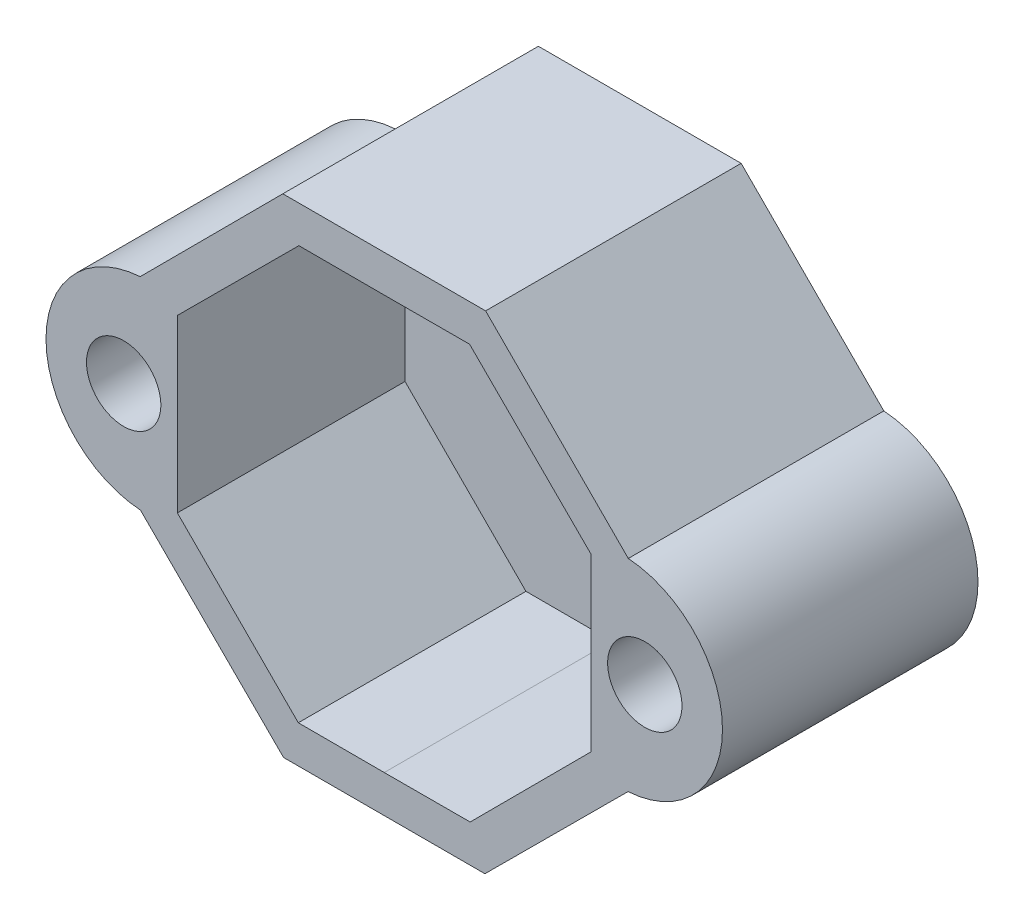
ISO-10303-21;
HEADER;
FILE_DESCRIPTION(('STEP AP214'),'2;1');
FILE_NAME('part.step','',(''),(''),'','','');
FILE_SCHEMA(('AUTOMOTIVE_DESIGN { 1 0 10303 214 1 1 1 1 }'));
ENDSEC;
DATA;
#1=APPLICATION_CONTEXT('core data for automotive mechanical design processes');
#2=APPLICATION_PROTOCOL_DEFINITION('international standard','automotive_design',2000,#1);
#3=PRODUCT_CONTEXT('',#1,'mechanical');
#4=PRODUCT('Part','Part','',(#3));
#5=PRODUCT_RELATED_PRODUCT_CATEGORY('part','',(#4));
#6=PRODUCT_DEFINITION_FORMATION('','',#4);
#7=PRODUCT_DEFINITION_CONTEXT('part definition',#1,'design');
#8=PRODUCT_DEFINITION('design','',#6,#7);
#9=PRODUCT_DEFINITION_SHAPE('','',#8);
#10=(LENGTH_UNIT() NAMED_UNIT(*) SI_UNIT(.MILLI.,.METRE.));
#11=(NAMED_UNIT(*) PLANE_ANGLE_UNIT() SI_UNIT($,.RADIAN.));
#12=(NAMED_UNIT(*) SI_UNIT($,.STERADIAN.) SOLID_ANGLE_UNIT());
#13=UNCERTAINTY_MEASURE_WITH_UNIT(LENGTH_MEASURE(1.E-05),#10,'distance_accuracy_value','');
#14=(GEOMETRIC_REPRESENTATION_CONTEXT(3) GLOBAL_UNCERTAINTY_ASSIGNED_CONTEXT((#13)) GLOBAL_UNIT_ASSIGNED_CONTEXT((#10,
#11,#12)) REPRESENTATION_CONTEXT('',''));
#15=CARTESIAN_POINT('',(0.,0.,0.));
#16=DIRECTION('',(0.,0.,1.));
#17=DIRECTION('',(1.,0.,0.));
#18=AXIS2_PLACEMENT_3D('',#15,#16,#17);
#19=CARTESIAN_POINT('',(-4.36451658606529,10.4936603456736,1.2));
#20=DIRECTION('',(-0.708135002050255,0.706077062983415,0.));
#21=DIRECTION('',(-0.706077062983415,-0.708135002050255,0.));
#22=AXIS2_PLACEMENT_3D('',#19,#20,#21);
#23=PLANE('',#22);
#24=DIRECTION('',(-0.706077062983415,-0.708135002050255,0.));
#25=VECTOR('',#24,1.);
#26=CARTESIAN_POINT('',(-4.36451658606529,10.4936603456736,11.));
#27=LINE('',#26,#25);
#28=CARTESIAN_POINT('',(-4.36451658606529,10.4936603456736,11.));
#29=VERTEX_POINT('',#28);
#30=CARTESIAN_POINT('',(-10.5063170194626,4.33395896106958,11.));
#31=VERTEX_POINT('',#30);
#32=EDGE_CURVE('E276',#29,#31,#27,.T.);
#33=ORIENTED_EDGE('',*,*,#32,.F.);
#34=DIRECTION('',(0.,0.,1.));
#35=VECTOR('',#34,1.);
#36=CARTESIAN_POINT('',(-4.36451658606529,10.4936603456736,1.2));
#37=LINE('',#36,#35);
#38=CARTESIAN_POINT('',(-4.36451658606529,10.4936603456736,0.));
#39=VERTEX_POINT('',#38);
#40=EDGE_CURVE('E11',#39,#29,#37,.T.);
#41=ORIENTED_EDGE('',*,*,#40,.F.);
#42=DIRECTION('',(0.706077062983415,0.708135002050255,0.));
#43=VECTOR('',#42,1.);
#44=CARTESIAN_POINT('',(-10.5063170194626,4.33395896106958,0.));
#45=LINE('',#44,#43);
#46=CARTESIAN_POINT('',(-10.5063170194626,4.33395896106958,0.));
#47=VERTEX_POINT('',#46);
#48=EDGE_CURVE('E199',#47,#39,#45,.T.);
#49=ORIENTED_EDGE('',*,*,#48,.F.);
#50=DIRECTION('',(0.,0.,1.));
#51=VECTOR('',#50,1.);
#52=CARTESIAN_POINT('',(-10.5063170194626,4.33395896106958,1.2));
#53=LINE('',#52,#51);
#54=EDGE_CURVE('E36',#47,#31,#53,.T.);
#55=ORIENTED_EDGE('',*,*,#54,.T.);
#56=EDGE_LOOP('',(#33,#41,#49,#55));
#57=FACE_BOUND('',#56,.T.);
#58=ADVANCED_FACE('F33',(#57),#23,.T.);
#59=CARTESIAN_POINT('',(-4.36451658606529,10.4936603456736,1.2));
#60=DIRECTION('',(0.,1.,0.));
#61=DIRECTION('',(0.,0.,1.));
#62=AXIS2_PLACEMENT_3D('',#59,#60,#61);
#63=PLANE('',#62);
#64=DIRECTION('',(-1.,0.,0.));
#65=VECTOR('',#64,1.);
#66=CARTESIAN_POINT('',(-4.36451658606529,10.4936603456736,11.));
#67=LINE('',#66,#65);
#68=CARTESIAN_POINT('',(4.36451658606529,10.4936603456736,11.));
#69=VERTEX_POINT('',#68);
#70=EDGE_CURVE('E311',#69,#29,#67,.T.);
#71=ORIENTED_EDGE('',*,*,#70,.F.);
#72=DIRECTION('',(0.,0.,1.));
#73=VECTOR('',#72,1.);
#74=CARTESIAN_POINT('',(4.36451658606529,10.4936603456736,1.2));
#75=LINE('',#74,#73);
#76=CARTESIAN_POINT('',(4.36451658606529,10.4936603456736,0.));
#77=VERTEX_POINT('',#76);
#78=EDGE_CURVE('E41',#77,#69,#75,.T.);
#79=ORIENTED_EDGE('',*,*,#78,.F.);
#80=DIRECTION('',(1.,0.,0.));
#81=VECTOR('',#80,1.);
#82=CARTESIAN_POINT('',(-4.36451658606529,10.4936603456736,0.));
#83=LINE('',#82,#81);
#84=EDGE_CURVE('E202',#39,#77,#83,.T.);
#85=ORIENTED_EDGE('',*,*,#84,.F.);
#86=ORIENTED_EDGE('',*,*,#40,.T.);
#87=EDGE_LOOP('',(#71,#79,#85,#86));
#88=FACE_BOUND('',#87,.T.);
#89=ADVANCED_FACE('F332',(#88),#63,.T.);
#90=CARTESIAN_POINT('',(4.36451658606529,10.4936603456736,1.2));
#91=DIRECTION('',(0.708135002050255,0.706077062983415,0.));
#92=DIRECTION('',(-0.706077062983415,0.708135002050255,0.));
#93=AXIS2_PLACEMENT_3D('',#90,#91,#92);
#94=PLANE('',#93);
#95=DIRECTION('',(-0.706077062983415,0.708135002050255,0.));
#96=VECTOR('',#95,1.);
#97=CARTESIAN_POINT('',(4.36451658606529,10.4936603456736,11.));
#98=LINE('',#97,#96);
#99=CARTESIAN_POINT('',(10.5063170194626,4.33395896106958,11.));
#100=VERTEX_POINT('',#99);
#101=EDGE_CURVE('E308',#100,#69,#98,.T.);
#102=ORIENTED_EDGE('',*,*,#101,.F.);
#103=DIRECTION('',(0.,0.,1.));
#104=VECTOR('',#103,1.);
#105=CARTESIAN_POINT('',(10.5063170194626,4.33395896106958,1.2));
#106=LINE('',#105,#104);
#107=CARTESIAN_POINT('',(10.5063170194626,4.33395896106958,0.));
#108=VERTEX_POINT('',#107);
#109=EDGE_CURVE('E168',#108,#100,#106,.T.);
#110=ORIENTED_EDGE('',*,*,#109,.F.);
#111=DIRECTION('',(0.706077062983415,-0.708135002050255,0.));
#112=VECTOR('',#111,1.);
#113=CARTESIAN_POINT('',(4.36451658606529,10.4936603456736,0.));
#114=LINE('',#113,#112);
#115=EDGE_CURVE('E184',#77,#108,#114,.T.);
#116=ORIENTED_EDGE('',*,*,#115,.F.);
#117=ORIENTED_EDGE('',*,*,#78,.T.);
#118=EDGE_LOOP('',(#102,#110,#116,#117));
#119=FACE_BOUND('',#118,.T.);
#120=ADVANCED_FACE('F352',(#119),#94,.T.);
#121=CARTESIAN_POINT('',(10.2008513279981,-0.0148435541707614,1.2));
#122=DIRECTION('',(0.,0.,1.));
#123=DIRECTION('',(1.,0.,0.));
#124=AXIS2_PLACEMENT_3D('',#121,#122,#123);
#125=CYLINDRICAL_SURFACE('',#124,4.35951747389807);
#126=CARTESIAN_POINT('',(10.2008513279981,-0.0148435541707614,11.));
#127=DIRECTION('',(0.,0.,1.));
#128=DIRECTION('',(-1.,0.,0.));
#129=AXIS2_PLACEMENT_3D('',#126,#127,#128);
#130=CIRCLE('',#129,4.35951747389807);
#131=CARTESIAN_POINT('',(10.4936603456736,-4.36451658606529,11.));
#132=VERTEX_POINT('',#131);
#133=EDGE_CURVE('E164',#132,#100,#130,.T.);
#134=ORIENTED_EDGE('',*,*,#133,.F.);
#135=DIRECTION('',(0.,0.,1.));
#136=VECTOR('',#135,1.);
#137=CARTESIAN_POINT('',(10.4936603456736,-4.36451658606529,1.2));
#138=LINE('',#137,#136);
#139=CARTESIAN_POINT('',(10.4936603456736,-4.36451658606529,0.));
#140=VERTEX_POINT('',#139);
#141=EDGE_CURVE('E158',#140,#132,#138,.T.);
#142=ORIENTED_EDGE('',*,*,#141,.F.);
#143=CARTESIAN_POINT('',(10.2008513279981,-0.0148435541707614,0.));
#144=DIRECTION('',(0.,0.,-1.));
#145=DIRECTION('',(-1.,0.,0.));
#146=AXIS2_PLACEMENT_3D('',#143,#144,#145);
#147=CIRCLE('',#146,4.35951747389807);
#148=EDGE_CURVE('E162',#108,#140,#147,.T.);
#149=ORIENTED_EDGE('',*,*,#148,.F.);
#150=ORIENTED_EDGE('',*,*,#109,.T.);
#151=EDGE_LOOP('',(#134,#142,#149,#150));
#152=FACE_BOUND('',#151,.T.);
#153=ADVANCED_FACE('F160',(#152),#125,.T.);
#154=CARTESIAN_POINT('',(4.33395896106958,-10.5063170194626,1.2));
#155=DIRECTION('',(0.706077062983415,-0.708135002050255,0.));
#156=DIRECTION('',(0.708135002050255,0.706077062983415,0.));
#157=AXIS2_PLACEMENT_3D('',#154,#155,#156);
#158=PLANE('',#157);
#159=DIRECTION('',(0.708135002050255,0.706077062983415,0.));
#160=VECTOR('',#159,1.);
#161=CARTESIAN_POINT('',(4.33395896106958,-10.5063170194626,11.));
#162=LINE('',#161,#160);
#163=CARTESIAN_POINT('',(4.33395896106958,-10.5063170194626,11.));
#164=VERTEX_POINT('',#163);
#165=EDGE_CURVE('E305',#164,#132,#162,.T.);
#166=ORIENTED_EDGE('',*,*,#165,.F.);
#167=DIRECTION('',(0.,0.,1.));
#168=VECTOR('',#167,1.);
#169=CARTESIAN_POINT('',(4.33395896106958,-10.5063170194626,1.2));
#170=LINE('',#169,#168);
#171=CARTESIAN_POINT('',(4.33395896106958,-10.5063170194626,0.));
#172=VERTEX_POINT('',#171);
#173=EDGE_CURVE('E169',#172,#164,#170,.T.);
#174=ORIENTED_EDGE('',*,*,#173,.F.);
#175=DIRECTION('',(-0.708135002050255,-0.706077062983415,0.));
#176=VECTOR('',#175,1.);
#177=CARTESIAN_POINT('',(10.4936603456736,-4.36451658606529,0.));
#178=LINE('',#177,#176);
#179=EDGE_CURVE('E172',#140,#172,#178,.T.);
#180=ORIENTED_EDGE('',*,*,#179,.F.);
#181=ORIENTED_EDGE('',*,*,#141,.T.);
#182=EDGE_LOOP('',(#166,#174,#180,#181));
#183=FACE_BOUND('',#182,.T.);
#184=ADVANCED_FACE('F173',(#183),#158,.T.);
#185=CARTESIAN_POINT('',(-4.33395896106958,-10.5063170194626,1.2));
#186=DIRECTION('',(0.,-1.,0.));
#187=DIRECTION('',(0.,0.,-1.));
#188=AXIS2_PLACEMENT_3D('',#185,#186,#187);
#189=PLANE('',#188);
#190=DIRECTION('',(1.,0.,0.));
#191=VECTOR('',#190,1.);
#192=CARTESIAN_POINT('',(-4.33395896106958,-10.5063170194626,11.));
#193=LINE('',#192,#191);
#194=CARTESIAN_POINT('',(-4.33395896106958,-10.5063170194626,11.));
#195=VERTEX_POINT('',#194);
#196=EDGE_CURVE('E302',#195,#164,#193,.T.);
#197=ORIENTED_EDGE('',*,*,#196,.F.);
#198=DIRECTION('',(0.,0.,1.));
#199=VECTOR('',#198,1.);
#200=CARTESIAN_POINT('',(-4.33395896106958,-10.5063170194626,1.2));
#201=LINE('',#200,#199);
#202=CARTESIAN_POINT('',(-4.33395896106958,-10.5063170194626,0.));
#203=VERTEX_POINT('',#202);
#204=EDGE_CURVE('E317',#203,#195,#201,.T.);
#205=ORIENTED_EDGE('',*,*,#204,.F.);
#206=DIRECTION('',(-1.,0.,0.));
#207=VECTOR('',#206,1.);
#208=CARTESIAN_POINT('',(4.33395896106958,-10.5063170194626,0.));
#209=LINE('',#208,#207);
#210=EDGE_CURVE('E177',#172,#203,#209,.T.);
#211=ORIENTED_EDGE('',*,*,#210,.F.);
#212=ORIENTED_EDGE('',*,*,#173,.T.);
#213=EDGE_LOOP('',(#197,#205,#211,#212));
#214=FACE_BOUND('',#213,.T.);
#215=ADVANCED_FACE('F339',(#214),#189,.T.);
#216=CARTESIAN_POINT('',(-4.33395896106958,-10.5063170194626,1.2));
#217=DIRECTION('',(-0.706077062983415,-0.708135002050255,0.));
#218=DIRECTION('',(0.708135002050255,-0.706077062983415,0.));
#219=AXIS2_PLACEMENT_3D('',#216,#217,#218);
#220=PLANE('',#219);
#221=DIRECTION('',(0.708135002050255,-0.706077062983415,0.));
#222=VECTOR('',#221,1.);
#223=CARTESIAN_POINT('',(-4.33395896106958,-10.5063170194626,11.));
#224=LINE('',#223,#222);
#225=CARTESIAN_POINT('',(-10.4936603456736,-4.36451658606529,11.));
#226=VERTEX_POINT('',#225);
#227=EDGE_CURVE('E299',#226,#195,#224,.T.);
#228=ORIENTED_EDGE('',*,*,#227,.F.);
#229=DIRECTION('',(0.,0.,1.));
#230=VECTOR('',#229,1.);
#231=CARTESIAN_POINT('',(-10.4936603456736,-4.36451658606529,1.2));
#232=LINE('',#231,#230);
#233=CARTESIAN_POINT('',(-10.4936603456736,-4.36451658606529,0.));
#234=VERTEX_POINT('',#233);
#235=EDGE_CURVE('E318',#234,#226,#232,.T.);
#236=ORIENTED_EDGE('',*,*,#235,.F.);
#237=DIRECTION('',(-0.708135002050255,0.706077062983415,0.));
#238=VECTOR('',#237,1.);
#239=CARTESIAN_POINT('',(-4.33395896106958,-10.5063170194626,0.));
#240=LINE('',#239,#238);
#241=EDGE_CURVE('E193',#203,#234,#240,.T.);
#242=ORIENTED_EDGE('',*,*,#241,.F.);
#243=ORIENTED_EDGE('',*,*,#204,.T.);
#244=EDGE_LOOP('',(#228,#236,#242,#243));
#245=FACE_BOUND('',#244,.T.);
#246=ADVANCED_FACE('F336',(#245),#220,.T.);
#247=CARTESIAN_POINT('',(-10.2008513279981,-0.0148435541707614,1.2));
#248=DIRECTION('',(0.,0.,1.));
#249=DIRECTION('',(1.,0.,0.));
#250=AXIS2_PLACEMENT_3D('',#247,#248,#249);
#251=CYLINDRICAL_SURFACE('',#250,4.35951747389807);
#252=CARTESIAN_POINT('',(-10.2008513279981,-0.0148435541707614,11.));
#253=DIRECTION('',(0.,0.,1.));
#254=DIRECTION('',(1.,0.,0.));
#255=AXIS2_PLACEMENT_3D('',#252,#253,#254);
#256=CIRCLE('',#255,4.35951747389807);
#257=EDGE_CURVE('E296',#31,#226,#256,.T.);
#258=ORIENTED_EDGE('',*,*,#257,.F.);
#259=ORIENTED_EDGE('',*,*,#54,.F.);
#260=CARTESIAN_POINT('',(-10.2008513279981,-0.0148435541707614,0.));
#261=DIRECTION('',(0.,0.,-1.));
#262=DIRECTION('',(-1.,0.,0.));
#263=AXIS2_PLACEMENT_3D('',#260,#261,#262);
#264=CIRCLE('',#263,4.35951747389807);
#265=EDGE_CURVE('E196',#234,#47,#264,.T.);
#266=ORIENTED_EDGE('',*,*,#265,.F.);
#267=ORIENTED_EDGE('',*,*,#235,.T.);
#268=EDGE_LOOP('',(#258,#259,#266,#267));
#269=FACE_BOUND('',#268,.T.);
#270=ADVANCED_FACE('F326',(#269),#251,.T.);
#271=CARTESIAN_POINT('',(-10.2008513279981,-0.0148435541707614,11.));
#272=DIRECTION('',(0.,0.,1.));
#273=DIRECTION('',(1.,0.,0.));
#274=AXIS2_PLACEMENT_3D('',#271,#272,#273);
#275=PLANE('',#274);
#276=CARTESIAN_POINT('',(11.2171797081828,-0.00887619444256418,11.));
#277=DIRECTION('',(0.,0.,1.));
#278=DIRECTION('',(1.,0.,0.));
#279=AXIS2_PLACEMENT_3D('',#276,#277,#278);
#280=CIRCLE('',#279,1.60000012368346);
#281=CARTESIAN_POINT('',(12.8171798318663,-0.00887619444256418,11.));
#282=VERTEX_POINT('',#281);
#283=EDGE_CURVE('E205',#282,#282,#280,.T.);
#284=ORIENTED_EDGE('',*,*,#283,.F.);
#285=EDGE_LOOP('',(#284));
#286=FACE_BOUND('',#285,.T.);
#287=CARTESIAN_POINT('',(-11.2171797081828,-0.00887619444256418,11.));
#288=DIRECTION('',(0.,0.,1.));
#289=DIRECTION('',(-1.,0.,0.));
#290=AXIS2_PLACEMENT_3D('',#287,#288,#289);
#291=CIRCLE('',#290,1.60000012368346);
#292=CARTESIAN_POINT('',(-12.8171798318663,-0.00887619444256418,11.));
#293=VERTEX_POINT('',#292);
#294=EDGE_CURVE('E209',#293,#293,#291,.T.);
#295=ORIENTED_EDGE('',*,*,#294,.F.);
#296=EDGE_LOOP('',(#295));
#297=FACE_BOUND('',#296,.T.);
#298=DIRECTION('',(-0.708135012325157,-0.706077052678565,0.));
#299=VECTOR('',#298,1.);
#300=CARTESIAN_POINT('',(-3.67354624904692,8.90535488724709,11.));
#301=LINE('',#300,#299);
#302=CARTESIAN_POINT('',(-3.67354624904692,8.90535488724709,11.));
#303=VERTEX_POINT('',#302);
#304=CARTESIAN_POINT('',(-8.89462698251009,3.6994474940002,11.));
#305=VERTEX_POINT('',#304);
#306=EDGE_CURVE('E57',#303,#305,#301,.T.);
#307=ORIENTED_EDGE('',*,*,#306,.F.);
#308=DIRECTION('',(-0.999998941449941,0.00145502542859038,0.));
#309=VECTOR('',#308,1.);
#310=CARTESIAN_POINT('',(0.,8.90000977838355,11.));
#311=LINE('',#310,#309);
#312=CARTESIAN_POINT('',(0.,8.90000977838355,11.));
#313=VERTEX_POINT('',#312);
#314=EDGE_CURVE('E221',#313,#303,#311,.T.);
#315=ORIENTED_EDGE('',*,*,#314,.F.);
#316=DIRECTION('',(-0.999998941449941,-0.00145502542859038,0.));
#317=VECTOR('',#316,1.);
#318=CARTESIAN_POINT('',(0.,8.90000977838355,11.));
#319=LINE('',#318,#317);
#320=CARTESIAN_POINT('',(3.67354624904692,8.90535488724709,11.));
#321=VERTEX_POINT('',#320);
#322=EDGE_CURVE('E269',#321,#313,#319,.T.);
#323=ORIENTED_EDGE('',*,*,#322,.F.);
#324=DIRECTION('',(-0.708135012325157,0.706077052678565,0.));
#325=VECTOR('',#324,1.);
#326=CARTESIAN_POINT('',(3.67354624904692,8.90535488724709,11.));
#327=LINE('',#326,#325);
#328=CARTESIAN_POINT('',(8.89462698251009,3.6994474940002,11.));
#329=VERTEX_POINT('',#328);
#330=EDGE_CURVE('E266',#329,#321,#327,.T.);
#331=ORIENTED_EDGE('',*,*,#330,.F.);
#332=DIRECTION('',(-0.0014550254285904,0.999998941449941,0.));
#333=VECTOR('',#332,1.);
#334=CARTESIAN_POINT('',(8.89462698251009,3.6994474940002,11.));
#335=LINE('',#334,#333);
#336=CARTESIAN_POINT('',(8.90535488724709,-3.67354624904692,11.));
#337=VERTEX_POINT('',#336);
#338=EDGE_CURVE('E263',#337,#329,#335,.T.);
#339=ORIENTED_EDGE('',*,*,#338,.F.);
#340=DIRECTION('',(0.706077052678565,0.708135012325157,0.));
#341=VECTOR('',#340,1.);
#342=CARTESIAN_POINT('',(8.90535488724709,-3.67354624904692,11.));
#343=LINE('',#342,#341);
#344=CARTESIAN_POINT('',(3.6994474940002,-8.89462698251009,11.));
#345=VERTEX_POINT('',#344);
#346=EDGE_CURVE('E260',#345,#337,#343,.T.);
#347=ORIENTED_EDGE('',*,*,#346,.F.);
#348=DIRECTION('',(0.999998941449941,0.00145502542859043,0.));
#349=VECTOR('',#348,1.);
#350=CARTESIAN_POINT('',(3.6994474940002,-8.89462698251009,11.));
#351=LINE('',#350,#349);
#352=CARTESIAN_POINT('',(0.,-8.90000977838355,11.));
#353=VERTEX_POINT('',#352);
#354=EDGE_CURVE('E257',#353,#345,#351,.T.);
#355=ORIENTED_EDGE('',*,*,#354,.F.);
#356=DIRECTION('',(0.999998941449941,-0.00145502542859043,0.));
#357=VECTOR('',#356,1.);
#358=CARTESIAN_POINT('',(-3.6994474940002,-8.89462698251009,11.));
#359=LINE('',#358,#357);
#360=CARTESIAN_POINT('',(-3.6994474940002,-8.89462698251009,11.));
#361=VERTEX_POINT('',#360);
#362=EDGE_CURVE('E254',#361,#353,#359,.T.);
#363=ORIENTED_EDGE('',*,*,#362,.F.);
#364=DIRECTION('',(0.706077052678565,-0.708135012325157,0.));
#365=VECTOR('',#364,1.);
#366=CARTESIAN_POINT('',(-8.90535488724709,-3.67354624904692,11.));
#367=LINE('',#366,#365);
#368=CARTESIAN_POINT('',(-8.90535488724709,-3.67354624904692,11.));
#369=VERTEX_POINT('',#368);
#370=EDGE_CURVE('E251',#369,#361,#367,.T.);
#371=ORIENTED_EDGE('',*,*,#370,.F.);
#372=DIRECTION('',(-0.0014550254285904,-0.999998941449941,0.));
#373=VECTOR('',#372,1.);
#374=CARTESIAN_POINT('',(-8.89462698251009,3.6994474940002,11.));
#375=LINE('',#374,#373);
#376=EDGE_CURVE('E248',#305,#369,#375,.T.);
#377=ORIENTED_EDGE('',*,*,#376,.F.);
#378=EDGE_LOOP('',(#307,#315,#323,#331,#339,#347,#355,#363,#371,#377));
#379=FACE_BOUND('',#378,.T.);
#380=ORIENTED_EDGE('',*,*,#32,.T.);
#381=ORIENTED_EDGE('',*,*,#257,.T.);
#382=ORIENTED_EDGE('',*,*,#227,.T.);
#383=ORIENTED_EDGE('',*,*,#196,.T.);
#384=ORIENTED_EDGE('',*,*,#165,.T.);
#385=ORIENTED_EDGE('',*,*,#133,.T.);
#386=ORIENTED_EDGE('',*,*,#101,.T.);
#387=ORIENTED_EDGE('',*,*,#70,.T.);
#388=EDGE_LOOP('',(#380,#381,#382,#383,#384,#385,#386,#387));
#389=FACE_BOUND('',#388,.T.);
#390=ADVANCED_FACE('F328',(#286,#297,#379,#389),#275,.T.);
#391=CARTESIAN_POINT('',(-3.67354624904692,8.90535488724709,1.2));
#392=DIRECTION('',(-0.706077052678565,0.708135012325158,0.));
#393=DIRECTION('',(-0.708135012325158,-0.706077052678565,0.));
#394=AXIS2_PLACEMENT_3D('',#391,#392,#393);
#395=PLANE('',#394);
#396=ORIENTED_EDGE('',*,*,#306,.T.);
#397=DIRECTION('',(0.,0.,1.));
#398=VECTOR('',#397,1.);
#399=CARTESIAN_POINT('',(-8.89462698251009,3.6994474940002,1.2));
#400=LINE('',#399,#398);
#401=CARTESIAN_POINT('',(-8.89462698251009,3.6994474940002,1.2));
#402=VERTEX_POINT('',#401);
#403=EDGE_CURVE('E246',#402,#305,#400,.T.);
#404=ORIENTED_EDGE('',*,*,#403,.F.);
#405=DIRECTION('',(-0.708135012325157,-0.706077052678565,0.));
#406=VECTOR('',#405,1.);
#407=CARTESIAN_POINT('',(-3.67354624904692,8.90535488724709,1.2));
#408=LINE('',#407,#406);
#409=CARTESIAN_POINT('',(-3.67354624904692,8.90535488724709,1.2));
#410=VERTEX_POINT('',#409);
#411=EDGE_CURVE('E217',#410,#402,#408,.T.);
#412=ORIENTED_EDGE('',*,*,#411,.F.);
#413=DIRECTION('',(0.,0.,1.));
#414=VECTOR('',#413,1.);
#415=CARTESIAN_POINT('',(-3.67354624904692,8.90535488724709,1.2));
#416=LINE('',#415,#414);
#417=EDGE_CURVE('E274',#410,#303,#416,.T.);
#418=ORIENTED_EDGE('',*,*,#417,.T.);
#419=EDGE_LOOP('',(#396,#404,#412,#418));
#420=FACE_BOUND('',#419,.T.);
#421=ADVANCED_FACE('F399',(#420),#395,.F.);
#422=CARTESIAN_POINT('',(0.,8.90000977838355,1.2));
#423=DIRECTION('',(0.00145502542859038,0.999998941449941,0.));
#424=DIRECTION('',(-0.999998941449941,0.00145502542859038,0.));
#425=AXIS2_PLACEMENT_3D('',#422,#423,#424);
#426=PLANE('',#425);
#427=ORIENTED_EDGE('',*,*,#314,.T.);
#428=ORIENTED_EDGE('',*,*,#417,.F.);
#429=DIRECTION('',(-0.999998941449941,0.00145502542859038,0.));
#430=VECTOR('',#429,1.);
#431=CARTESIAN_POINT('',(0.,8.90000977838355,1.2));
#432=LINE('',#431,#430);
#433=CARTESIAN_POINT('',(0.,8.90000977838355,1.2));
#434=VERTEX_POINT('',#433);
#435=EDGE_CURVE('E243',#434,#410,#432,.T.);
#436=ORIENTED_EDGE('',*,*,#435,.F.);
#437=DIRECTION('',(0.,0.,1.));
#438=VECTOR('',#437,1.);
#439=CARTESIAN_POINT('',(0.,8.90000977838355,1.2));
#440=LINE('',#439,#438);
#441=EDGE_CURVE('E277',#434,#313,#440,.T.);
#442=ORIENTED_EDGE('',*,*,#441,.T.);
#443=EDGE_LOOP('',(#427,#428,#436,#442));
#444=FACE_BOUND('',#443,.T.);
#445=ADVANCED_FACE('F404',(#444),#426,.F.);
#446=CARTESIAN_POINT('',(0.,8.90000977838355,1.2));
#447=DIRECTION('',(-0.00145502542859038,0.999998941449941,0.));
#448=DIRECTION('',(-0.999998941449941,-0.00145502542859038,0.));
#449=AXIS2_PLACEMENT_3D('',#446,#447,#448);
#450=PLANE('',#449);
#451=ORIENTED_EDGE('',*,*,#322,.T.);
#452=ORIENTED_EDGE('',*,*,#441,.F.);
#453=DIRECTION('',(-0.999998941449941,-0.00145502542859038,0.));
#454=VECTOR('',#453,1.);
#455=CARTESIAN_POINT('',(0.,8.90000977838355,1.2));
#456=LINE('',#455,#454);
#457=CARTESIAN_POINT('',(3.67354624904692,8.90535488724709,1.2));
#458=VERTEX_POINT('',#457);
#459=EDGE_CURVE('E240',#458,#434,#456,.T.);
#460=ORIENTED_EDGE('',*,*,#459,.F.);
#461=DIRECTION('',(0.,0.,1.));
#462=VECTOR('',#461,1.);
#463=CARTESIAN_POINT('',(3.67354624904692,8.90535488724709,1.2));
#464=LINE('',#463,#462);
#465=EDGE_CURVE('E279',#458,#321,#464,.T.);
#466=ORIENTED_EDGE('',*,*,#465,.T.);
#467=EDGE_LOOP('',(#451,#452,#460,#466));
#468=FACE_BOUND('',#467,.T.);
#469=ADVANCED_FACE('F413',(#468),#450,.F.);
#470=CARTESIAN_POINT('',(3.67354624904692,8.90535488724709,1.2));
#471=DIRECTION('',(0.706077052678565,0.708135012325158,0.));
#472=DIRECTION('',(-0.708135012325158,0.706077052678565,0.));
#473=AXIS2_PLACEMENT_3D('',#470,#471,#472);
#474=PLANE('',#473);
#475=ORIENTED_EDGE('',*,*,#330,.T.);
#476=ORIENTED_EDGE('',*,*,#465,.F.);
#477=DIRECTION('',(-0.708135012325157,0.706077052678565,0.));
#478=VECTOR('',#477,1.);
#479=CARTESIAN_POINT('',(3.67354624904692,8.90535488724709,1.2));
#480=LINE('',#479,#478);
#481=CARTESIAN_POINT('',(8.89462698251009,3.6994474940002,1.2));
#482=VERTEX_POINT('',#481);
#483=EDGE_CURVE('E237',#482,#458,#480,.T.);
#484=ORIENTED_EDGE('',*,*,#483,.F.);
#485=DIRECTION('',(0.,0.,1.));
#486=VECTOR('',#485,1.);
#487=CARTESIAN_POINT('',(8.89462698251009,3.6994474940002,1.2));
#488=LINE('',#487,#486);
#489=EDGE_CURVE('E281',#482,#329,#488,.T.);
#490=ORIENTED_EDGE('',*,*,#489,.T.);
#491=EDGE_LOOP('',(#475,#476,#484,#490));
#492=FACE_BOUND('',#491,.T.);
#493=ADVANCED_FACE('F423',(#492),#474,.F.);
#494=CARTESIAN_POINT('',(8.89462698251009,3.6994474940002,1.2));
#495=DIRECTION('',(0.999998941449941,0.0014550254285904,0.));
#496=DIRECTION('',(-0.0014550254285904,0.999998941449941,0.));
#497=AXIS2_PLACEMENT_3D('',#494,#495,#496);
#498=PLANE('',#497);
#499=ORIENTED_EDGE('',*,*,#338,.T.);
#500=ORIENTED_EDGE('',*,*,#489,.F.);
#501=DIRECTION('',(-0.0014550254285904,0.999998941449941,0.));
#502=VECTOR('',#501,1.);
#503=CARTESIAN_POINT('',(8.89462698251009,3.6994474940002,1.2));
#504=LINE('',#503,#502);
#505=CARTESIAN_POINT('',(8.90535488724709,-3.67354624904692,1.2));
#506=VERTEX_POINT('',#505);
#507=EDGE_CURVE('E234',#506,#482,#504,.T.);
#508=ORIENTED_EDGE('',*,*,#507,.F.);
#509=DIRECTION('',(0.,0.,1.));
#510=VECTOR('',#509,1.);
#511=CARTESIAN_POINT('',(8.90535488724709,-3.67354624904692,1.2));
#512=LINE('',#511,#510);
#513=EDGE_CURVE('E283',#506,#337,#512,.T.);
#514=ORIENTED_EDGE('',*,*,#513,.T.);
#515=EDGE_LOOP('',(#499,#500,#508,#514));
#516=FACE_BOUND('',#515,.T.);
#517=ADVANCED_FACE('F433',(#516),#498,.F.);
#518=CARTESIAN_POINT('',(8.90535488724709,-3.67354624904692,1.2));
#519=DIRECTION('',(0.708135012325158,-0.706077052678565,0.));
#520=DIRECTION('',(0.706077052678565,0.708135012325158,0.));
#521=AXIS2_PLACEMENT_3D('',#518,#519,#520);
#522=PLANE('',#521);
#523=ORIENTED_EDGE('',*,*,#346,.T.);
#524=ORIENTED_EDGE('',*,*,#513,.F.);
#525=DIRECTION('',(0.706077052678565,0.708135012325157,0.));
#526=VECTOR('',#525,1.);
#527=CARTESIAN_POINT('',(8.90535488724709,-3.67354624904692,1.2));
#528=LINE('',#527,#526);
#529=CARTESIAN_POINT('',(3.6994474940002,-8.89462698251009,1.2));
#530=VERTEX_POINT('',#529);
#531=EDGE_CURVE('E231',#530,#506,#528,.T.);
#532=ORIENTED_EDGE('',*,*,#531,.F.);
#533=DIRECTION('',(0.,0.,1.));
#534=VECTOR('',#533,1.);
#535=CARTESIAN_POINT('',(3.6994474940002,-8.89462698251009,1.2));
#536=LINE('',#535,#534);
#537=EDGE_CURVE('E285',#530,#345,#536,.T.);
#538=ORIENTED_EDGE('',*,*,#537,.T.);
#539=EDGE_LOOP('',(#523,#524,#532,#538));
#540=FACE_BOUND('',#539,.T.);
#541=ADVANCED_FACE('F443',(#540),#522,.F.);
#542=CARTESIAN_POINT('',(3.6994474940002,-8.89462698251009,1.2));
#543=DIRECTION('',(0.00145502542859043,-0.999998941449941,0.));
#544=DIRECTION('',(0.999998941449941,0.00145502542859043,0.));
#545=AXIS2_PLACEMENT_3D('',#542,#543,#544);
#546=PLANE('',#545);
#547=ORIENTED_EDGE('',*,*,#354,.T.);
#548=ORIENTED_EDGE('',*,*,#537,.F.);
#549=DIRECTION('',(0.999998941449941,0.00145502542859043,0.));
#550=VECTOR('',#549,1.);
#551=CARTESIAN_POINT('',(3.6994474940002,-8.89462698251009,1.2));
#552=LINE('',#551,#550);
#553=CARTESIAN_POINT('',(0.,-8.90000977838355,1.2));
#554=VERTEX_POINT('',#553);
#555=EDGE_CURVE('E228',#554,#530,#552,.T.);
#556=ORIENTED_EDGE('',*,*,#555,.F.);
#557=DIRECTION('',(0.,0.,1.));
#558=VECTOR('',#557,1.);
#559=CARTESIAN_POINT('',(0.,-8.90000977838355,1.2));
#560=LINE('',#559,#558);
#561=EDGE_CURVE('E287',#554,#353,#560,.T.);
#562=ORIENTED_EDGE('',*,*,#561,.T.);
#563=EDGE_LOOP('',(#547,#548,#556,#562));
#564=FACE_BOUND('',#563,.T.);
#565=ADVANCED_FACE('F453',(#564),#546,.F.);
#566=CARTESIAN_POINT('',(-3.6994474940002,-8.89462698251009,1.2));
#567=DIRECTION('',(-0.00145502542859043,-0.999998941449941,0.));
#568=DIRECTION('',(0.999998941449941,-0.00145502542859043,0.));
#569=AXIS2_PLACEMENT_3D('',#566,#567,#568);
#570=PLANE('',#569);
#571=ORIENTED_EDGE('',*,*,#362,.T.);
#572=ORIENTED_EDGE('',*,*,#561,.F.);
#573=DIRECTION('',(0.999998941449941,-0.00145502542859043,0.));
#574=VECTOR('',#573,1.);
#575=CARTESIAN_POINT('',(-3.6994474940002,-8.89462698251009,1.2));
#576=LINE('',#575,#574);
#577=CARTESIAN_POINT('',(-3.6994474940002,-8.89462698251009,1.2));
#578=VERTEX_POINT('',#577);
#579=EDGE_CURVE('E225',#578,#554,#576,.T.);
#580=ORIENTED_EDGE('',*,*,#579,.F.);
#581=DIRECTION('',(0.,0.,1.));
#582=VECTOR('',#581,1.);
#583=CARTESIAN_POINT('',(-3.6994474940002,-8.89462698251009,1.2));
#584=LINE('',#583,#582);
#585=EDGE_CURVE('E289',#578,#361,#584,.T.);
#586=ORIENTED_EDGE('',*,*,#585,.T.);
#587=EDGE_LOOP('',(#571,#572,#580,#586));
#588=FACE_BOUND('',#587,.T.);
#589=ADVANCED_FACE('F463',(#588),#570,.F.);
#590=CARTESIAN_POINT('',(-8.90535488724709,-3.67354624904692,1.2));
#591=DIRECTION('',(-0.708135012325158,-0.706077052678565,0.));
#592=DIRECTION('',(0.706077052678565,-0.708135012325158,0.));
#593=AXIS2_PLACEMENT_3D('',#590,#591,#592);
#594=PLANE('',#593);
#595=ORIENTED_EDGE('',*,*,#370,.T.);
#596=ORIENTED_EDGE('',*,*,#585,.F.);
#597=DIRECTION('',(0.706077052678565,-0.708135012325157,0.));
#598=VECTOR('',#597,1.);
#599=CARTESIAN_POINT('',(-8.90535488724709,-3.67354624904692,1.2));
#600=LINE('',#599,#598);
#601=CARTESIAN_POINT('',(-8.90535488724709,-3.67354624904692,1.2));
#602=VERTEX_POINT('',#601);
#603=EDGE_CURVE('E49',#602,#578,#600,.T.);
#604=ORIENTED_EDGE('',*,*,#603,.F.);
#605=DIRECTION('',(0.,0.,1.));
#606=VECTOR('',#605,1.);
#607=CARTESIAN_POINT('',(-8.90535488724709,-3.67354624904692,1.2));
#608=LINE('',#607,#606);
#609=EDGE_CURVE('E291',#602,#369,#608,.T.);
#610=ORIENTED_EDGE('',*,*,#609,.T.);
#611=EDGE_LOOP('',(#595,#596,#604,#610));
#612=FACE_BOUND('',#611,.T.);
#613=ADVANCED_FACE('F473',(#612),#594,.F.);
#614=CARTESIAN_POINT('',(-8.89462698251009,3.6994474940002,1.2));
#615=DIRECTION('',(-0.999998941449941,0.0014550254285904,0.));
#616=DIRECTION('',(-0.0014550254285904,-0.999998941449941,0.));
#617=AXIS2_PLACEMENT_3D('',#614,#615,#616);
#618=PLANE('',#617);
#619=ORIENTED_EDGE('',*,*,#376,.T.);
#620=ORIENTED_EDGE('',*,*,#609,.F.);
#621=DIRECTION('',(-0.0014550254285904,-0.999998941449941,0.));
#622=VECTOR('',#621,1.);
#623=CARTESIAN_POINT('',(-8.89462698251009,3.6994474940002,1.2));
#624=LINE('',#623,#622);
#625=EDGE_CURVE('E220',#402,#602,#624,.T.);
#626=ORIENTED_EDGE('',*,*,#625,.F.);
#627=ORIENTED_EDGE('',*,*,#403,.T.);
#628=EDGE_LOOP('',(#619,#620,#626,#627));
#629=FACE_BOUND('',#628,.T.);
#630=ADVANCED_FACE('F483',(#629),#618,.F.);
#631=CARTESIAN_POINT('',(-11.2171797081828,-0.00887619444256418,1.2));
#632=DIRECTION('',(0.,0.,1.));
#633=DIRECTION('',(1.,0.,0.));
#634=AXIS2_PLACEMENT_3D('',#631,#632,#633);
#635=CYLINDRICAL_SURFACE('',#634,1.60000012368346);
#636=CARTESIAN_POINT('',(-11.2171797081828,-0.00887619444256418,1.2));
#637=DIRECTION('',(0.,0.,1.));
#638=DIRECTION('',(-1.,0.,0.));
#639=AXIS2_PLACEMENT_3D('',#636,#637,#638);
#640=CIRCLE('',#639,1.60000012368346);
#641=CARTESIAN_POINT('',(-12.8171798318663,-0.00887619444256418,1.2));
#642=VERTEX_POINT('',#641);
#643=EDGE_CURVE('E212',#642,#642,#640,.T.);
#644=ORIENTED_EDGE('',*,*,#643,.F.);
#645=EDGE_LOOP('',(#644));
#646=FACE_BOUND('',#645,.T.);
#647=ORIENTED_EDGE('',*,*,#294,.T.);
#648=EDGE_LOOP('',(#647));
#649=FACE_BOUND('',#648,.T.);
#650=ADVANCED_FACE('F492',(#646,#649),#635,.F.);
#651=CARTESIAN_POINT('',(11.2171797081828,-0.00887619444256418,1.2));
#652=DIRECTION('',(0.,0.,1.));
#653=DIRECTION('',(1.,0.,0.));
#654=AXIS2_PLACEMENT_3D('',#651,#652,#653);
#655=CYLINDRICAL_SURFACE('',#654,1.60000012368346);
#656=CARTESIAN_POINT('',(11.2171797081828,-0.00887619444256418,1.2));
#657=DIRECTION('',(0.,0.,1.));
#658=DIRECTION('',(1.,0.,0.));
#659=AXIS2_PLACEMENT_3D('',#656,#657,#658);
#660=CIRCLE('',#659,1.60000012368346);
#661=CARTESIAN_POINT('',(12.8171798318663,-0.00887619444256418,1.2));
#662=VERTEX_POINT('',#661);
#663=EDGE_CURVE('E206',#662,#662,#660,.T.);
#664=ORIENTED_EDGE('',*,*,#663,.F.);
#665=EDGE_LOOP('',(#664));
#666=FACE_BOUND('',#665,.T.);
#667=ORIENTED_EDGE('',*,*,#283,.T.);
#668=EDGE_LOOP('',(#667));
#669=FACE_BOUND('',#668,.T.);
#670=ADVANCED_FACE('F504',(#666,#669),#655,.F.);
#671=CARTESIAN_POINT('',(0.,0.,0.));
#672=DIRECTION('',(0.,0.,1.));
#673=DIRECTION('',(1.,0.,0.));
#674=AXIS2_PLACEMENT_3D('',#671,#672,#673);
#675=CYLINDRICAL_SURFACE('',#674,3.94999999546694);
#676=CARTESIAN_POINT('',(0.,0.,0.));
#677=DIRECTION('',(0.,0.,-1.));
#678=DIRECTION('',(-1.,0.,0.));
#679=AXIS2_PLACEMENT_3D('',#676,#677,#678);
#680=CIRCLE('',#679,3.94999999546694);
#681=CARTESIAN_POINT('',(-3.94999999546694,0.,0.));
#682=VERTEX_POINT('',#681);
#683=EDGE_CURVE('E185',#682,#682,#680,.T.);
#684=ORIENTED_EDGE('',*,*,#683,.T.);
#685=EDGE_LOOP('',(#684));
#686=FACE_BOUND('',#685,.T.);
#687=CARTESIAN_POINT('',(0.,0.,1.2));
#688=DIRECTION('',(0.,0.,-1.));
#689=DIRECTION('',(-1.,0.,0.));
#690=AXIS2_PLACEMENT_3D('',#687,#688,#689);
#691=CIRCLE('',#690,3.94999999546694);
#692=CARTESIAN_POINT('',(-3.94999999546694,0.,1.2));
#693=VERTEX_POINT('',#692);
#694=EDGE_CURVE('E188',#693,#693,#691,.T.);
#695=ORIENTED_EDGE('',*,*,#694,.F.);
#696=EDGE_LOOP('',(#695));
#697=FACE_BOUND('',#696,.T.);
#698=ADVANCED_FACE('F500',(#686,#697),#675,.F.);
#699=CARTESIAN_POINT('',(10.2008513279981,-0.0148435541707614,0.));
#700=DIRECTION('',(0.,0.,-1.));
#701=DIRECTION('',(-1.,0.,0.));
#702=AXIS2_PLACEMENT_3D('',#699,#700,#701);
#703=PLANE('',#702);
#704=ORIENTED_EDGE('',*,*,#148,.T.);
#705=ORIENTED_EDGE('',*,*,#179,.T.);
#706=ORIENTED_EDGE('',*,*,#210,.T.);
#707=ORIENTED_EDGE('',*,*,#241,.T.);
#708=ORIENTED_EDGE('',*,*,#265,.T.);
#709=ORIENTED_EDGE('',*,*,#48,.T.);
#710=ORIENTED_EDGE('',*,*,#84,.T.);
#711=ORIENTED_EDGE('',*,*,#115,.T.);
#712=EDGE_LOOP('',(#704,#705,#706,#707,#708,#709,#710,#711));
#713=FACE_BOUND('',#712,.T.);
#714=ORIENTED_EDGE('',*,*,#683,.F.);
#715=EDGE_LOOP('',(#714));
#716=FACE_BOUND('',#715,.T.);
#717=ADVANCED_FACE('F180',(#713,#716),#703,.T.);
#718=CARTESIAN_POINT('',(10.2008513279981,-0.0148435541707614,1.2));
#719=DIRECTION('',(0.,0.,-1.));
#720=DIRECTION('',(-1.,0.,0.));
#721=AXIS2_PLACEMENT_3D('',#718,#719,#720);
#722=PLANE('',#721);
#723=ORIENTED_EDGE('',*,*,#694,.T.);
#724=EDGE_LOOP('',(#723));
#725=FACE_BOUND('',#724,.T.);
#726=ORIENTED_EDGE('',*,*,#459,.T.);
#727=ORIENTED_EDGE('',*,*,#435,.T.);
#728=ORIENTED_EDGE('',*,*,#411,.T.);
#729=ORIENTED_EDGE('',*,*,#625,.T.);
#730=ORIENTED_EDGE('',*,*,#603,.T.);
#731=ORIENTED_EDGE('',*,*,#579,.T.);
#732=ORIENTED_EDGE('',*,*,#555,.T.);
#733=ORIENTED_EDGE('',*,*,#531,.T.);
#734=ORIENTED_EDGE('',*,*,#507,.T.);
#735=ORIENTED_EDGE('',*,*,#483,.T.);
#736=EDGE_LOOP('',(#726,#727,#728,#729,#730,#731,#732,#733,#734,#735));
#737=FACE_BOUND('',#736,.T.);
#738=ADVANCED_FACE('F515',(#725,#737),#722,.F.);
#739=ORIENTED_EDGE('',*,*,#643,.T.);
#740=EDGE_LOOP('',(#739));
#741=FACE_BOUND('',#740,.T.);
#742=ADVANCED_FACE('F524',(#741),#722,.F.);
#743=ORIENTED_EDGE('',*,*,#663,.T.);
#744=EDGE_LOOP('',(#743));
#745=FACE_BOUND('',#744,.T.);
#746=ADVANCED_FACE('F527',(#745),#722,.F.);
#747=CLOSED_SHELL('',(#58,#89,#120,#153,#184,#215,#246,#270,#390,#421,#445,#469,#493,#517,#541,
#565,#589,#613,#630,#650,#670,#698,#717,#738,#742,#746));
#748=MANIFOLD_SOLID_BREP('B2',#747);
#749=ADVANCED_BREP_SHAPE_REPRESENTATION('',(#18,#748),#14);
#750=SHAPE_DEFINITION_REPRESENTATION(#9,#749);
ENDSEC;
END-ISO-10303-21;
